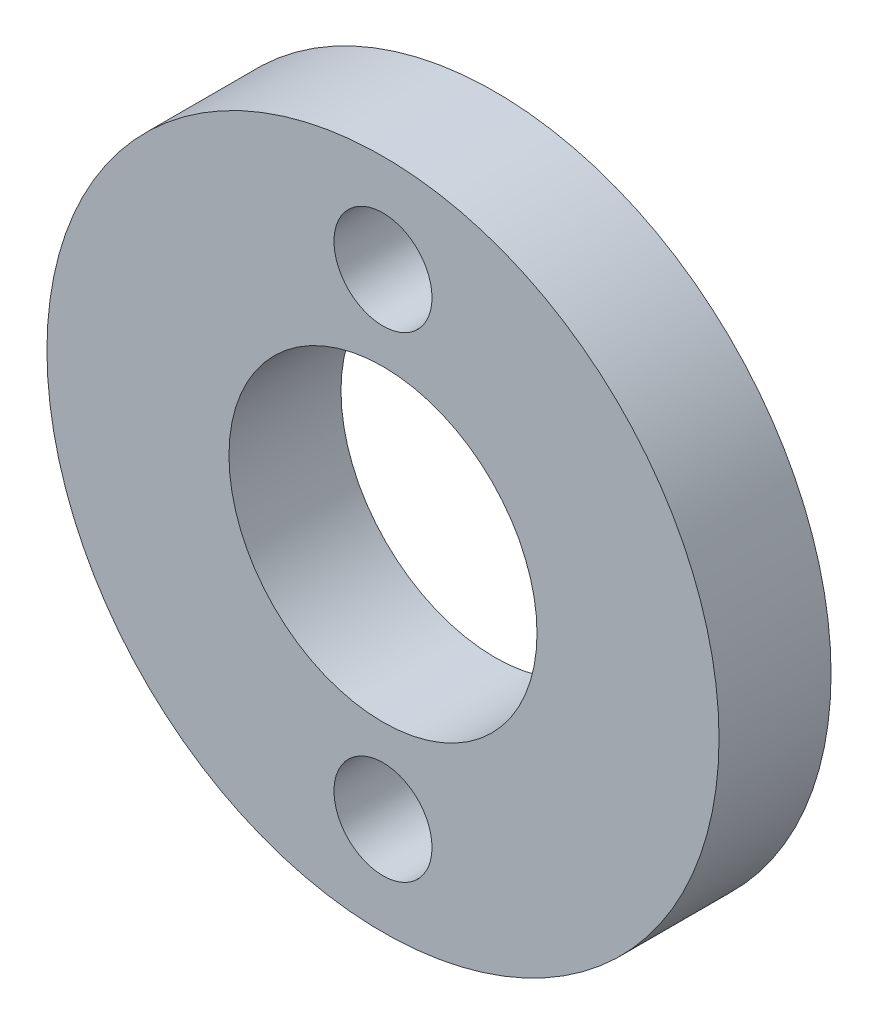
ISO-10303-21;
HEADER;
FILE_DESCRIPTION(('STEP AP214'),'2;1');
FILE_NAME('part.step','',(''),(''),'','','');
FILE_SCHEMA(('AUTOMOTIVE_DESIGN { 1 0 10303 214 1 1 1 1 }'));
ENDSEC;
DATA;
#1=APPLICATION_CONTEXT('core data for automotive mechanical design processes');
#2=APPLICATION_PROTOCOL_DEFINITION('international standard','automotive_design',2000,#1);
#3=PRODUCT_CONTEXT('',#1,'mechanical');
#4=PRODUCT('Part','Part','',(#3));
#5=PRODUCT_RELATED_PRODUCT_CATEGORY('part','',(#4));
#6=PRODUCT_DEFINITION_FORMATION('','',#4);
#7=PRODUCT_DEFINITION_CONTEXT('part definition',#1,'design');
#8=PRODUCT_DEFINITION('design','',#6,#7);
#9=PRODUCT_DEFINITION_SHAPE('','',#8);
#10=(LENGTH_UNIT() NAMED_UNIT(*) SI_UNIT(.MILLI.,.METRE.));
#11=(NAMED_UNIT(*) PLANE_ANGLE_UNIT() SI_UNIT($,.RADIAN.));
#12=(NAMED_UNIT(*) SI_UNIT($,.STERADIAN.) SOLID_ANGLE_UNIT());
#13=UNCERTAINTY_MEASURE_WITH_UNIT(LENGTH_MEASURE(1.E-05),#10,'distance_accuracy_value','');
#14=(GEOMETRIC_REPRESENTATION_CONTEXT(3) GLOBAL_UNCERTAINTY_ASSIGNED_CONTEXT((#13)) GLOBAL_UNIT_ASSIGNED_CONTEXT((#10,
#11,#12)) REPRESENTATION_CONTEXT('',''));
#15=CARTESIAN_POINT('',(0.,0.,0.));
#16=DIRECTION('',(0.,0.,1.));
#17=DIRECTION('',(1.,0.,0.));
#18=AXIS2_PLACEMENT_3D('',#15,#16,#17);
#19=CARTESIAN_POINT('',(0.,0.,4.));
#20=DIRECTION('',(0.,0.,1.));
#21=DIRECTION('',(1.,0.,0.));
#22=AXIS2_PLACEMENT_3D('',#19,#20,#21);
#23=PLANE('',#22);
#24=CARTESIAN_POINT('',(0.,8.5,4.));
#25=DIRECTION('',(0.,0.,1.));
#26=DIRECTION('',(1.,0.,0.));
#27=AXIS2_PLACEMENT_3D('',#24,#25,#26);
#28=CIRCLE('',#27,1.75);
#29=CARTESIAN_POINT('',(1.75,8.5,4.));
#30=VERTEX_POINT('',#29);
#31=EDGE_CURVE('E49',#30,#30,#28,.T.);
#32=ORIENTED_EDGE('',*,*,#31,.F.);
#33=EDGE_LOOP('',(#32));
#34=FACE_BOUND('',#33,.T.);
#35=CARTESIAN_POINT('',(0.,0.,4.));
#36=DIRECTION('',(0.,0.,1.));
#37=DIRECTION('',(1.,0.,0.));
#38=AXIS2_PLACEMENT_3D('',#35,#36,#37);
#39=CIRCLE('',#38,12.);
#40=CARTESIAN_POINT('',(12.,0.,4.));
#41=VERTEX_POINT('',#40);
#42=EDGE_CURVE('E10',#41,#41,#39,.T.);
#43=ORIENTED_EDGE('',*,*,#42,.T.);
#44=EDGE_LOOP('',(#43));
#45=FACE_BOUND('',#44,.T.);
#46=CARTESIAN_POINT('',(0.,0.,4.));
#47=DIRECTION('',(0.,0.,1.));
#48=DIRECTION('',(1.,0.,0.));
#49=AXIS2_PLACEMENT_3D('',#46,#47,#48);
#50=CIRCLE('',#49,5.5);
#51=CARTESIAN_POINT('',(5.5,0.,4.));
#52=VERTEX_POINT('',#51);
#53=EDGE_CURVE('E44',#52,#52,#50,.T.);
#54=ORIENTED_EDGE('',*,*,#53,.F.);
#55=EDGE_LOOP('',(#54));
#56=FACE_BOUND('',#55,.T.);
#57=CARTESIAN_POINT('',(0.,-8.5,4.));
#58=DIRECTION('',(0.,0.,1.));
#59=DIRECTION('',(1.,0.,0.));
#60=AXIS2_PLACEMENT_3D('',#57,#58,#59);
#61=CIRCLE('',#60,1.75);
#62=CARTESIAN_POINT('',(1.75,-8.5,4.));
#63=VERTEX_POINT('',#62);
#64=EDGE_CURVE('E55',#63,#63,#61,.T.);
#65=ORIENTED_EDGE('',*,*,#64,.F.);
#66=EDGE_LOOP('',(#65));
#67=FACE_BOUND('',#66,.T.);
#68=ADVANCED_FACE('F33',(#34,#45,#56,#67),#23,.T.);
#69=CARTESIAN_POINT('',(0.,0.,0.));
#70=DIRECTION('',(0.,0.,1.));
#71=DIRECTION('',(1.,0.,0.));
#72=AXIS2_PLACEMENT_3D('',#69,#70,#71);
#73=PLANE('',#72);
#74=CARTESIAN_POINT('',(0.,0.,0.));
#75=DIRECTION('',(0.,0.,1.));
#76=DIRECTION('',(1.,0.,0.));
#77=AXIS2_PLACEMENT_3D('',#74,#75,#76);
#78=CIRCLE('',#77,12.);
#79=CARTESIAN_POINT('',(12.,0.,0.));
#80=VERTEX_POINT('',#79);
#81=EDGE_CURVE('E37',#80,#80,#78,.T.);
#82=ORIENTED_EDGE('',*,*,#81,.F.);
#83=EDGE_LOOP('',(#82));
#84=FACE_BOUND('',#83,.T.);
#85=CARTESIAN_POINT('',(0.,0.,0.));
#86=DIRECTION('',(0.,0.,1.));
#87=DIRECTION('',(1.,0.,0.));
#88=AXIS2_PLACEMENT_3D('',#85,#86,#87);
#89=CIRCLE('',#88,5.5);
#90=CARTESIAN_POINT('',(5.5,0.,0.));
#91=VERTEX_POINT('',#90);
#92=EDGE_CURVE('E46',#91,#91,#89,.T.);
#93=ORIENTED_EDGE('',*,*,#92,.T.);
#94=EDGE_LOOP('',(#93));
#95=FACE_BOUND('',#94,.T.);
#96=CARTESIAN_POINT('',(0.,8.5,0.));
#97=DIRECTION('',(0.,0.,1.));
#98=DIRECTION('',(1.,0.,0.));
#99=AXIS2_PLACEMENT_3D('',#96,#97,#98);
#100=CIRCLE('',#99,1.75);
#101=CARTESIAN_POINT('',(1.75,8.5,0.));
#102=VERTEX_POINT('',#101);
#103=EDGE_CURVE('E52',#102,#102,#100,.T.);
#104=ORIENTED_EDGE('',*,*,#103,.T.);
#105=EDGE_LOOP('',(#104));
#106=FACE_BOUND('',#105,.T.);
#107=CARTESIAN_POINT('',(0.,-8.5,0.));
#108=DIRECTION('',(0.,0.,1.));
#109=DIRECTION('',(1.,0.,0.));
#110=AXIS2_PLACEMENT_3D('',#107,#108,#109);
#111=CIRCLE('',#110,1.75);
#112=CARTESIAN_POINT('',(1.75,-8.5,0.));
#113=VERTEX_POINT('',#112);
#114=EDGE_CURVE('E58',#113,#113,#111,.T.);
#115=ORIENTED_EDGE('',*,*,#114,.T.);
#116=EDGE_LOOP('',(#115));
#117=FACE_BOUND('',#116,.T.);
#118=ADVANCED_FACE('F68',(#84,#95,#106,#117),#73,.F.);
#119=CARTESIAN_POINT('',(0.,0.,4.));
#120=DIRECTION('',(0.,0.,-1.));
#121=DIRECTION('',(-1.,0.,0.));
#122=AXIS2_PLACEMENT_3D('',#119,#120,#121);
#123=CYLINDRICAL_SURFACE('',#122,12.);
#124=ORIENTED_EDGE('',*,*,#42,.F.);
#125=EDGE_LOOP('',(#124));
#126=FACE_BOUND('',#125,.T.);
#127=ORIENTED_EDGE('',*,*,#81,.T.);
#128=EDGE_LOOP('',(#127));
#129=FACE_BOUND('',#128,.T.);
#130=ADVANCED_FACE('F35',(#126,#129),#123,.T.);
#131=CARTESIAN_POINT('',(0.,0.,4.));
#132=DIRECTION('',(0.,0.,-1.));
#133=DIRECTION('',(-1.,0.,0.));
#134=AXIS2_PLACEMENT_3D('',#131,#132,#133);
#135=CYLINDRICAL_SURFACE('',#134,5.5);
#136=ORIENTED_EDGE('',*,*,#53,.T.);
#137=EDGE_LOOP('',(#136));
#138=FACE_BOUND('',#137,.T.);
#139=ORIENTED_EDGE('',*,*,#92,.F.);
#140=EDGE_LOOP('',(#139));
#141=FACE_BOUND('',#140,.T.);
#142=ADVANCED_FACE('F77',(#138,#141),#135,.F.);
#143=CARTESIAN_POINT('',(0.,8.5,4.));
#144=DIRECTION('',(0.,0.,-1.));
#145=DIRECTION('',(-1.,0.,0.));
#146=AXIS2_PLACEMENT_3D('',#143,#144,#145);
#147=CYLINDRICAL_SURFACE('',#146,1.75);
#148=ORIENTED_EDGE('',*,*,#31,.T.);
#149=EDGE_LOOP('',(#148));
#150=FACE_BOUND('',#149,.T.);
#151=ORIENTED_EDGE('',*,*,#103,.F.);
#152=EDGE_LOOP('',(#151));
#153=FACE_BOUND('',#152,.T.);
#154=ADVANCED_FACE('F80',(#150,#153),#147,.F.);
#155=CARTESIAN_POINT('',(0.,-8.5,4.));
#156=DIRECTION('',(0.,0.,-1.));
#157=DIRECTION('',(-1.,0.,0.));
#158=AXIS2_PLACEMENT_3D('',#155,#156,#157);
#159=CYLINDRICAL_SURFACE('',#158,1.75);
#160=ORIENTED_EDGE('',*,*,#64,.T.);
#161=EDGE_LOOP('',(#160));
#162=FACE_BOUND('',#161,.T.);
#163=ORIENTED_EDGE('',*,*,#114,.F.);
#164=EDGE_LOOP('',(#163));
#165=FACE_BOUND('',#164,.T.);
#166=ADVANCED_FACE('F64',(#162,#165),#159,.F.);
#167=CLOSED_SHELL('',(#68,#118,#130,#142,#154,#166));
#168=MANIFOLD_SOLID_BREP('B2',#167);
#169=ADVANCED_BREP_SHAPE_REPRESENTATION('',(#18,#168),#14);
#170=SHAPE_DEFINITION_REPRESENTATION(#9,#169);
ENDSEC;
END-ISO-10303-21;
